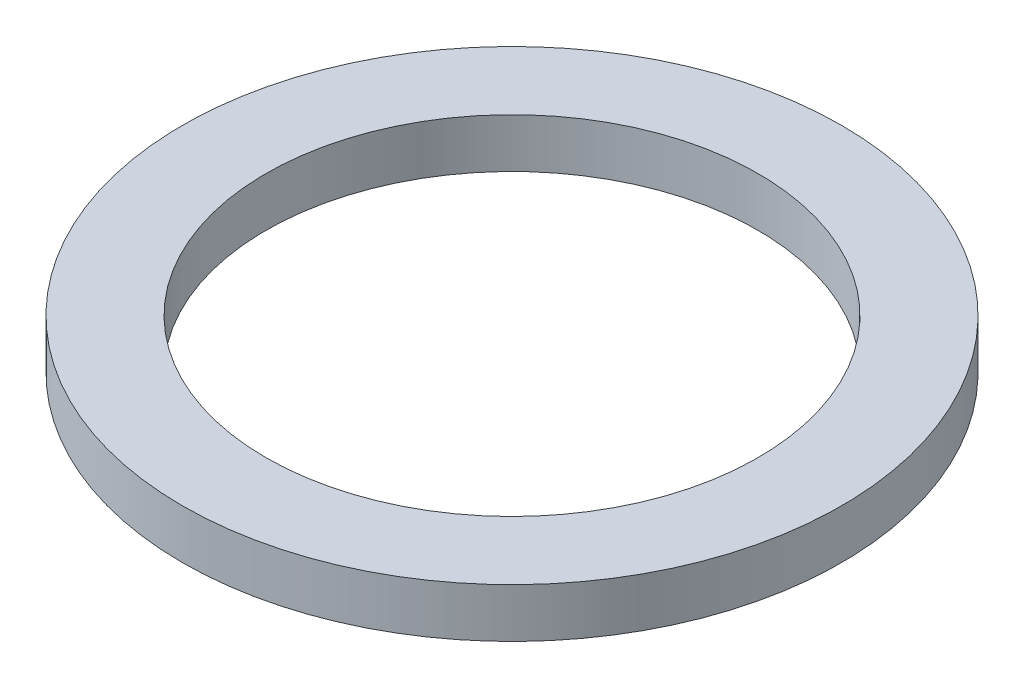
ISO-10303-21;
HEADER;
FILE_DESCRIPTION(('STEP AP214'),'2;1');
FILE_NAME('part.step','',(''),(''),'','','');
FILE_SCHEMA(('AUTOMOTIVE_DESIGN { 1 0 10303 214 1 1 1 1 }'));
ENDSEC;
DATA;
#1=APPLICATION_CONTEXT('core data for automotive mechanical design processes');
#2=APPLICATION_PROTOCOL_DEFINITION('international standard','automotive_design',2000,#1);
#3=PRODUCT_CONTEXT('',#1,'mechanical');
#4=PRODUCT('Part','Part','',(#3));
#5=PRODUCT_RELATED_PRODUCT_CATEGORY('part','',(#4));
#6=PRODUCT_DEFINITION_FORMATION('','',#4);
#7=PRODUCT_DEFINITION_CONTEXT('part definition',#1,'design');
#8=PRODUCT_DEFINITION('design','',#6,#7);
#9=PRODUCT_DEFINITION_SHAPE('','',#8);
#10=(LENGTH_UNIT() NAMED_UNIT(*) SI_UNIT(.MILLI.,.METRE.));
#11=(NAMED_UNIT(*) PLANE_ANGLE_UNIT() SI_UNIT($,.RADIAN.));
#12=(NAMED_UNIT(*) SI_UNIT($,.STERADIAN.) SOLID_ANGLE_UNIT());
#13=UNCERTAINTY_MEASURE_WITH_UNIT(LENGTH_MEASURE(1.E-05),#10,'distance_accuracy_value','');
#14=(GEOMETRIC_REPRESENTATION_CONTEXT(3) GLOBAL_UNCERTAINTY_ASSIGNED_CONTEXT((#13)) GLOBAL_UNIT_ASSIGNED_CONTEXT((#10,
#11,#12)) REPRESENTATION_CONTEXT('',''));
#15=CARTESIAN_POINT('',(0.,0.,0.));
#16=DIRECTION('',(0.,0.,1.));
#17=DIRECTION('',(1.,0.,0.));
#18=AXIS2_PLACEMENT_3D('',#15,#16,#17);
#19=CARTESIAN_POINT('',(0.,0.7112,0.));
#20=DIRECTION('',(0.,-1.,0.));
#21=DIRECTION('',(0.,0.,-1.));
#22=AXIS2_PLACEMENT_3D('',#19,#20,#21);
#23=CYLINDRICAL_SURFACE('',#22,4.7625);
#24=CARTESIAN_POINT('',(0.,0.7112,0.));
#25=DIRECTION('',(0.,1.,0.));
#26=DIRECTION('',(0.,0.,1.));
#27=AXIS2_PLACEMENT_3D('',#24,#25,#26);
#28=CIRCLE('',#27,4.7625);
#29=CARTESIAN_POINT('',(0.,0.7112,4.7625));
#30=VERTEX_POINT('',#29);
#31=EDGE_CURVE('E10',#30,#30,#28,.T.);
#32=ORIENTED_EDGE('',*,*,#31,.F.);
#33=EDGE_LOOP('',(#32));
#34=FACE_BOUND('',#33,.T.);
#35=CARTESIAN_POINT('',(0.,0.,0.));
#36=DIRECTION('',(0.,1.,0.));
#37=DIRECTION('',(0.,0.,1.));
#38=AXIS2_PLACEMENT_3D('',#35,#36,#37);
#39=CIRCLE('',#38,4.7625);
#40=CARTESIAN_POINT('',(0.,0.,4.7625));
#41=VERTEX_POINT('',#40);
#42=EDGE_CURVE('E41',#41,#41,#39,.T.);
#43=ORIENTED_EDGE('',*,*,#42,.T.);
#44=EDGE_LOOP('',(#43));
#45=FACE_BOUND('',#44,.T.);
#46=ADVANCED_FACE('F38',(#34,#45),#23,.T.);
#47=CARTESIAN_POINT('',(0.,0.7112,0.));
#48=DIRECTION('',(0.,1.,0.));
#49=DIRECTION('',(0.,0.,1.));
#50=AXIS2_PLACEMENT_3D('',#47,#48,#49);
#51=PLANE('',#50);
#52=CARTESIAN_POINT('',(0.,0.7112,0.));
#53=DIRECTION('',(0.,1.,0.));
#54=DIRECTION('',(0.,0.,1.));
#55=AXIS2_PLACEMENT_3D('',#52,#53,#54);
#56=CIRCLE('',#55,3.556);
#57=CARTESIAN_POINT('',(0.,0.7112,3.556));
#58=VERTEX_POINT('',#57);
#59=EDGE_CURVE('E53',#58,#58,#56,.T.);
#60=ORIENTED_EDGE('',*,*,#59,.F.);
#61=EDGE_LOOP('',(#60));
#62=FACE_BOUND('',#61,.T.);
#63=ORIENTED_EDGE('',*,*,#31,.T.);
#64=EDGE_LOOP('',(#63));
#65=FACE_BOUND('',#64,.T.);
#66=ADVANCED_FACE('F69',(#62,#65),#51,.T.);
#67=CARTESIAN_POINT('',(0.,0.,0.));
#68=DIRECTION('',(0.,1.,0.));
#69=DIRECTION('',(0.,0.,1.));
#70=AXIS2_PLACEMENT_3D('',#67,#68,#69);
#71=PLANE('',#70);
#72=CARTESIAN_POINT('',(0.,0.,0.));
#73=DIRECTION('',(0.,1.,0.));
#74=DIRECTION('',(0.,0.,1.));
#75=AXIS2_PLACEMENT_3D('',#72,#73,#74);
#76=CIRCLE('',#75,3.556);
#77=CARTESIAN_POINT('',(0.,0.,3.556));
#78=VERTEX_POINT('',#77);
#79=EDGE_CURVE('E51',#78,#78,#76,.T.);
#80=ORIENTED_EDGE('',*,*,#79,.T.);
#81=EDGE_LOOP('',(#80));
#82=FACE_BOUND('',#81,.T.);
#83=ORIENTED_EDGE('',*,*,#42,.F.);
#84=EDGE_LOOP('',(#83));
#85=FACE_BOUND('',#84,.T.);
#86=ADVANCED_FACE('F60',(#82,#85),#71,.F.);
#87=CARTESIAN_POINT('',(0.,0.,0.));
#88=DIRECTION('',(0.,1.,0.));
#89=DIRECTION('',(0.,0.,1.));
#90=AXIS2_PLACEMENT_3D('',#87,#88,#89);
#91=CYLINDRICAL_SURFACE('',#90,3.556);
#92=ORIENTED_EDGE('',*,*,#79,.F.);
#93=EDGE_LOOP('',(#92));
#94=FACE_BOUND('',#93,.T.);
#95=ORIENTED_EDGE('',*,*,#59,.T.);
#96=EDGE_LOOP('',(#95));
#97=FACE_BOUND('',#96,.T.);
#98=ADVANCED_FACE('F63',(#94,#97),#91,.F.);
#99=CLOSED_SHELL('',(#46,#66,#86,#98));
#100=MANIFOLD_SOLID_BREP('B2',#99);
#101=ADVANCED_BREP_SHAPE_REPRESENTATION('',(#18,#100),#14);
#102=SHAPE_DEFINITION_REPRESENTATION(#9,#101);
ENDSEC;
END-ISO-10303-21;
